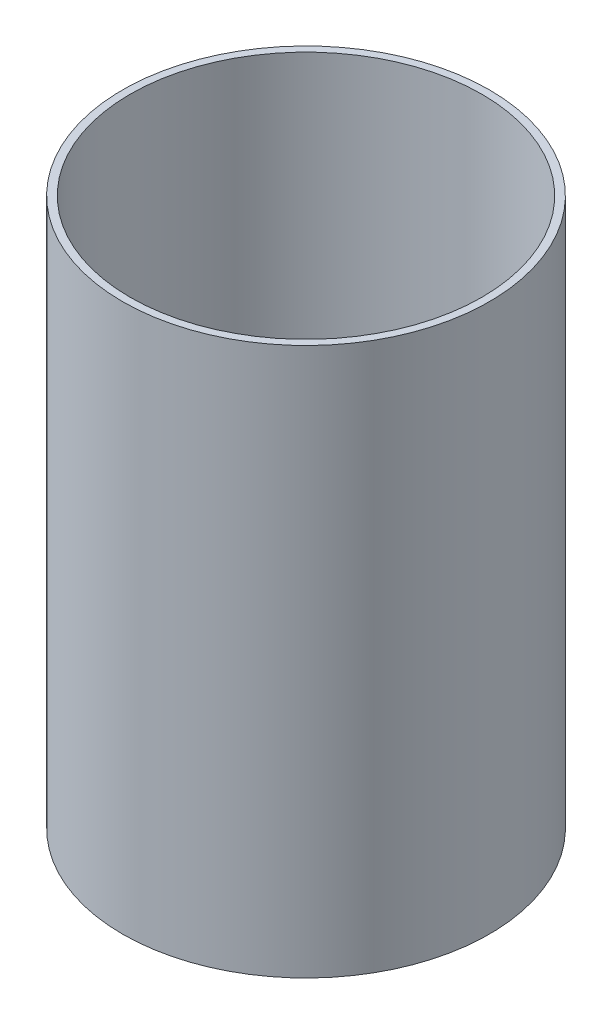
ISO-10303-21;
HEADER;
FILE_DESCRIPTION(('STEP AP214'),'2;1');
FILE_NAME('part.step','',(''),(''),'','','');
FILE_SCHEMA(('AUTOMOTIVE_DESIGN { 1 0 10303 214 1 1 1 1 }'));
ENDSEC;
DATA;
#1=APPLICATION_CONTEXT('core data for automotive mechanical design processes');
#2=APPLICATION_PROTOCOL_DEFINITION('international standard','automotive_design',2000,#1);
#3=PRODUCT_CONTEXT('',#1,'mechanical');
#4=PRODUCT('Part','Part','',(#3));
#5=PRODUCT_RELATED_PRODUCT_CATEGORY('part','',(#4));
#6=PRODUCT_DEFINITION_FORMATION('','',#4);
#7=PRODUCT_DEFINITION_CONTEXT('part definition',#1,'design');
#8=PRODUCT_DEFINITION('design','',#6,#7);
#9=PRODUCT_DEFINITION_SHAPE('','',#8);
#10=(LENGTH_UNIT() NAMED_UNIT(*) SI_UNIT(.MILLI.,.METRE.));
#11=(NAMED_UNIT(*) PLANE_ANGLE_UNIT() SI_UNIT($,.RADIAN.));
#12=(NAMED_UNIT(*) SI_UNIT($,.STERADIAN.) SOLID_ANGLE_UNIT());
#13=UNCERTAINTY_MEASURE_WITH_UNIT(LENGTH_MEASURE(1.E-05),#10,'distance_accuracy_value','');
#14=(GEOMETRIC_REPRESENTATION_CONTEXT(3) GLOBAL_UNCERTAINTY_ASSIGNED_CONTEXT((#13)) GLOBAL_UNIT_ASSIGNED_CONTEXT((#10,
#11,#12)) REPRESENTATION_CONTEXT('',''));
#15=CARTESIAN_POINT('',(0.,0.,0.));
#16=DIRECTION('',(0.,0.,1.));
#17=DIRECTION('',(1.,0.,0.));
#18=AXIS2_PLACEMENT_3D('',#15,#16,#17);
#19=CARTESIAN_POINT('',(0.,109.,0.));
#20=DIRECTION('',(0.,-1.,0.));
#21=DIRECTION('',(0.,0.,-1.));
#22=AXIS2_PLACEMENT_3D('',#19,#20,#21);
#23=CYLINDRICAL_SURFACE('',#22,36.5);
#24=CARTESIAN_POINT('',(0.,109.,0.));
#25=DIRECTION('',(0.,1.,0.));
#26=DIRECTION('',(0.,0.,1.));
#27=AXIS2_PLACEMENT_3D('',#24,#25,#26);
#28=CIRCLE('',#27,36.5);
#29=CARTESIAN_POINT('',(0.,109.,36.5));
#30=VERTEX_POINT('',#29);
#31=EDGE_CURVE('E10',#30,#30,#28,.T.);
#32=ORIENTED_EDGE('',*,*,#31,.F.);
#33=EDGE_LOOP('',(#32));
#34=FACE_BOUND('',#33,.T.);
#35=CARTESIAN_POINT('',(0.,0.,0.));
#36=DIRECTION('',(0.,1.,0.));
#37=DIRECTION('',(0.,0.,1.));
#38=AXIS2_PLACEMENT_3D('',#35,#36,#37);
#39=CIRCLE('',#38,36.5);
#40=CARTESIAN_POINT('',(0.,0.,36.5));
#41=VERTEX_POINT('',#40);
#42=EDGE_CURVE('E42',#41,#41,#39,.T.);
#43=ORIENTED_EDGE('',*,*,#42,.T.);
#44=EDGE_LOOP('',(#43));
#45=FACE_BOUND('',#44,.T.);
#46=ADVANCED_FACE('F39',(#34,#45),#23,.T.);
#47=CARTESIAN_POINT('',(0.,109.,0.));
#48=DIRECTION('',(0.,1.,0.));
#49=DIRECTION('',(0.,0.,1.));
#50=AXIS2_PLACEMENT_3D('',#47,#48,#49);
#51=PLANE('',#50);
#52=CARTESIAN_POINT('',(0.,109.,0.));
#53=DIRECTION('',(0.,1.,0.));
#54=DIRECTION('',(0.,0.,1.));
#55=AXIS2_PLACEMENT_3D('',#52,#53,#54);
#56=CIRCLE('',#55,35.);
#57=CARTESIAN_POINT('',(0.,109.,35.));
#58=VERTEX_POINT('',#57);
#59=EDGE_CURVE('E49',#58,#58,#56,.T.);
#60=ORIENTED_EDGE('',*,*,#59,.F.);
#61=EDGE_LOOP('',(#60));
#62=FACE_BOUND('',#61,.T.);
#63=ORIENTED_EDGE('',*,*,#31,.T.);
#64=EDGE_LOOP('',(#63));
#65=FACE_BOUND('',#64,.T.);
#66=ADVANCED_FACE('F70',(#62,#65),#51,.T.);
#67=CARTESIAN_POINT('',(0.,0.,0.));
#68=DIRECTION('',(0.,1.,0.));
#69=DIRECTION('',(0.,0.,1.));
#70=AXIS2_PLACEMENT_3D('',#67,#68,#69);
#71=PLANE('',#70);
#72=ORIENTED_EDGE('',*,*,#42,.F.);
#73=EDGE_LOOP('',(#72));
#74=FACE_BOUND('',#73,.T.);
#75=ADVANCED_FACE('F61',(#74),#71,.F.);
#76=CARTESIAN_POINT('',(0.,109.,0.));
#77=DIRECTION('',(0.,-1.,0.));
#78=DIRECTION('',(0.,0.,-1.));
#79=AXIS2_PLACEMENT_3D('',#76,#77,#78);
#80=CYLINDRICAL_SURFACE('',#79,35.);
#81=ORIENTED_EDGE('',*,*,#59,.T.);
#82=EDGE_LOOP('',(#81));
#83=FACE_BOUND('',#82,.T.);
#84=CARTESIAN_POINT('',(0.,1.5,0.));
#85=DIRECTION('',(0.,1.,0.));
#86=DIRECTION('',(0.,0.,1.));
#87=AXIS2_PLACEMENT_3D('',#84,#85,#86);
#88=CIRCLE('',#87,35.);
#89=CARTESIAN_POINT('',(0.,1.5,35.));
#90=VERTEX_POINT('',#89);
#91=EDGE_CURVE('E53',#90,#90,#88,.T.);
#92=ORIENTED_EDGE('',*,*,#91,.F.);
#93=EDGE_LOOP('',(#92));
#94=FACE_BOUND('',#93,.T.);
#95=ADVANCED_FACE('F59',(#83,#94),#80,.F.);
#96=CARTESIAN_POINT('',(0.,1.5,0.));
#97=DIRECTION('',(0.,1.,0.));
#98=DIRECTION('',(0.,0.,1.));
#99=AXIS2_PLACEMENT_3D('',#96,#97,#98);
#100=PLANE('',#99);
#101=ORIENTED_EDGE('',*,*,#91,.T.);
#102=EDGE_LOOP('',(#101));
#103=FACE_BOUND('',#102,.T.);
#104=ADVANCED_FACE('F57',(#103),#100,.T.);
#105=CLOSED_SHELL('',(#46,#66,#75,#95,#104));
#106=MANIFOLD_SOLID_BREP('B2',#105);
#107=ADVANCED_BREP_SHAPE_REPRESENTATION('',(#18,#106),#14);
#108=SHAPE_DEFINITION_REPRESENTATION(#9,#107);
ENDSEC;
END-ISO-10303-21;
